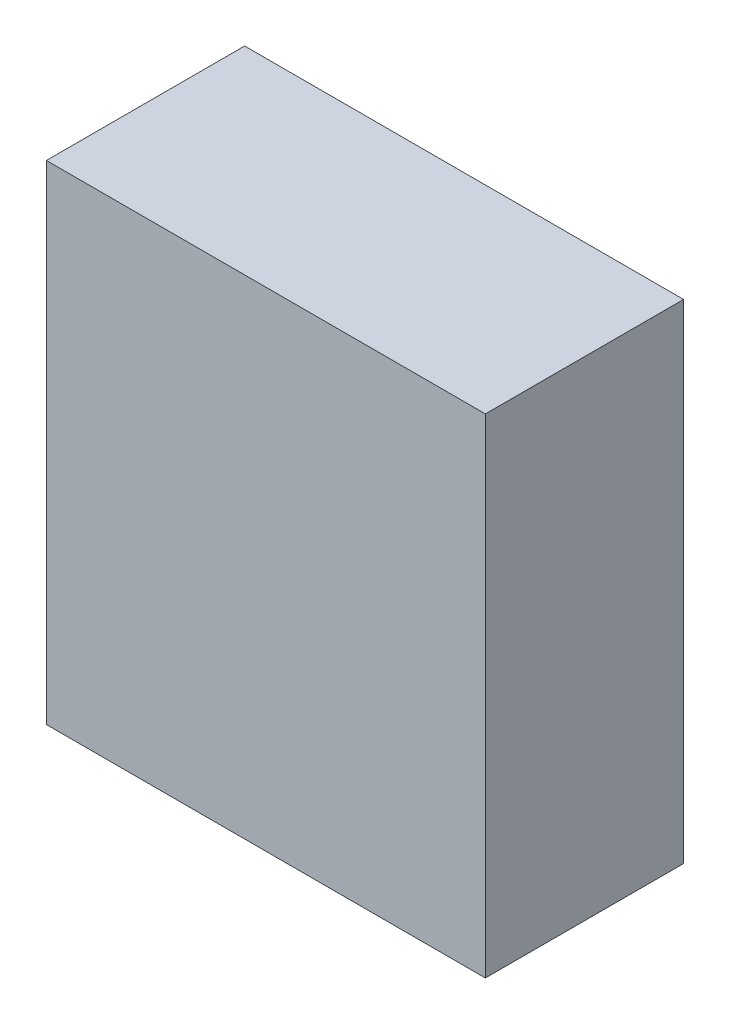
ISO-10303-21;
HEADER;
FILE_DESCRIPTION(('STEP AP214'),'2;1');
FILE_NAME('part.step','',(''),(''),'','','');
FILE_SCHEMA(('AUTOMOTIVE_DESIGN { 1 0 10303 214 1 1 1 1 }'));
ENDSEC;
DATA;
#1=APPLICATION_CONTEXT('core data for automotive mechanical design processes');
#2=APPLICATION_PROTOCOL_DEFINITION('international standard','automotive_design',2000,#1);
#3=PRODUCT_CONTEXT('',#1,'mechanical');
#4=PRODUCT('Part','Part','',(#3));
#5=PRODUCT_RELATED_PRODUCT_CATEGORY('part','',(#4));
#6=PRODUCT_DEFINITION_FORMATION('','',#4);
#7=PRODUCT_DEFINITION_CONTEXT('part definition',#1,'design');
#8=PRODUCT_DEFINITION('design','',#6,#7);
#9=PRODUCT_DEFINITION_SHAPE('','',#8);
#10=(LENGTH_UNIT() NAMED_UNIT(*) SI_UNIT(.MILLI.,.METRE.));
#11=(NAMED_UNIT(*) PLANE_ANGLE_UNIT() SI_UNIT($,.RADIAN.));
#12=(NAMED_UNIT(*) SI_UNIT($,.STERADIAN.) SOLID_ANGLE_UNIT());
#13=UNCERTAINTY_MEASURE_WITH_UNIT(LENGTH_MEASURE(1.E-05),#10,'distance_accuracy_value','');
#14=(GEOMETRIC_REPRESENTATION_CONTEXT(3) GLOBAL_UNCERTAINTY_ASSIGNED_CONTEXT((#13)) GLOBAL_UNIT_ASSIGNED_CONTEXT((#10,
#11,#12)) REPRESENTATION_CONTEXT('',''));
#15=CARTESIAN_POINT('',(0.,0.,0.));
#16=DIRECTION('',(0.,0.,1.));
#17=DIRECTION('',(1.,0.,0.));
#18=AXIS2_PLACEMENT_3D('',#15,#16,#17);
#19=CARTESIAN_POINT('',(-1.54999944,-1.72500036,1.39999974));
#20=DIRECTION('',(0.,0.,-1.));
#21=DIRECTION('',(-1.,0.,0.));
#22=AXIS2_PLACEMENT_3D('',#19,#20,#21);
#23=PLANE('',#22);
#24=DIRECTION('',(0.,1.,0.));
#25=VECTOR('',#24,1.);
#26=CARTESIAN_POINT('',(1.54999944,-1.72500036,1.39999974));
#27=LINE('',#26,#25);
#28=CARTESIAN_POINT('',(1.54999944,-1.72500036,1.39999974));
#29=VERTEX_POINT('',#28);
#30=CARTESIAN_POINT('',(1.54999944,1.72500036,1.39999974));
#31=VERTEX_POINT('',#30);
#32=EDGE_CURVE('E55',#29,#31,#27,.T.);
#33=ORIENTED_EDGE('',*,*,#32,.T.);
#34=DIRECTION('',(1.,0.,0.));
#35=VECTOR('',#34,1.);
#36=CARTESIAN_POINT('',(1.54999944,1.72500036,1.39999974));
#37=LINE('',#36,#35);
#38=CARTESIAN_POINT('',(-1.54999944,1.72500036,1.39999974));
#39=VERTEX_POINT('',#38);
#40=EDGE_CURVE('E57',#31,#39,#37,.F.);
#41=ORIENTED_EDGE('',*,*,#40,.T.);
#42=DIRECTION('',(0.,1.,0.));
#43=VECTOR('',#42,1.);
#44=CARTESIAN_POINT('',(-1.54999944,1.72500036,1.39999974));
#45=LINE('',#44,#43);
#46=CARTESIAN_POINT('',(-1.54999944,-1.72500036,1.39999974));
#47=VERTEX_POINT('',#46);
#48=EDGE_CURVE('E20',#39,#47,#45,.F.);
#49=ORIENTED_EDGE('',*,*,#48,.T.);
#50=DIRECTION('',(1.,0.,0.));
#51=VECTOR('',#50,1.);
#52=CARTESIAN_POINT('',(-1.54999944,-1.72500036,1.39999974));
#53=LINE('',#52,#51);
#54=EDGE_CURVE('E80',#47,#29,#53,.T.);
#55=ORIENTED_EDGE('',*,*,#54,.T.);
#56=EDGE_LOOP('',(#33,#41,#49,#55));
#57=FACE_BOUND('',#56,.T.);
#58=ADVANCED_FACE('F17',(#57),#23,.F.);
#59=CARTESIAN_POINT('',(-1.54999944,1.72500036,0.));
#60=DIRECTION('',(1.,0.,0.));
#61=DIRECTION('',(0.,0.,-1.));
#62=AXIS2_PLACEMENT_3D('',#59,#60,#61);
#63=PLANE('',#62);
#64=DIRECTION('',(0.,0.,1.));
#65=VECTOR('',#64,1.);
#66=CARTESIAN_POINT('',(-1.54999944,-1.72500036,0.));
#67=LINE('',#66,#65);
#68=CARTESIAN_POINT('',(-1.54999944,-1.72500036,0.));
#69=VERTEX_POINT('',#68);
#70=EDGE_CURVE('E68',#69,#47,#67,.T.);
#71=ORIENTED_EDGE('',*,*,#70,.T.);
#72=ORIENTED_EDGE('',*,*,#48,.F.);
#73=DIRECTION('',(0.,0.,-1.));
#74=VECTOR('',#73,1.);
#75=CARTESIAN_POINT('',(-1.54999944,1.72500036,0.));
#76=LINE('',#75,#74);
#77=CARTESIAN_POINT('',(-1.54999944,1.72500036,0.));
#78=VERTEX_POINT('',#77);
#79=EDGE_CURVE('E63',#39,#78,#76,.T.);
#80=ORIENTED_EDGE('',*,*,#79,.T.);
#81=DIRECTION('',(0.,1.,0.));
#82=VECTOR('',#81,1.);
#83=CARTESIAN_POINT('',(-1.54999944,-1.72500036,0.));
#84=LINE('',#83,#82);
#85=EDGE_CURVE('E83',#69,#78,#84,.T.);
#86=ORIENTED_EDGE('',*,*,#85,.F.);
#87=EDGE_LOOP('',(#71,#72,#80,#86));
#88=FACE_BOUND('',#87,.T.);
#89=ADVANCED_FACE('F65',(#88),#63,.F.);
#90=CARTESIAN_POINT('',(1.54999944,1.72500036,0.));
#91=DIRECTION('',(0.,-1.,0.));
#92=DIRECTION('',(0.,0.,-1.));
#93=AXIS2_PLACEMENT_3D('',#90,#91,#92);
#94=PLANE('',#93);
#95=ORIENTED_EDGE('',*,*,#79,.F.);
#96=ORIENTED_EDGE('',*,*,#40,.F.);
#97=DIRECTION('',(0.,0.,1.));
#98=VECTOR('',#97,1.);
#99=CARTESIAN_POINT('',(1.54999944,1.72500036,0.));
#100=LINE('',#99,#98);
#101=CARTESIAN_POINT('',(1.54999944,1.72500036,0.));
#102=VERTEX_POINT('',#101);
#103=EDGE_CURVE('E75',#31,#102,#100,.F.);
#104=ORIENTED_EDGE('',*,*,#103,.T.);
#105=DIRECTION('',(-1.,0.,0.));
#106=VECTOR('',#105,1.);
#107=CARTESIAN_POINT('',(-1.54999944,1.72500036,0.));
#108=LINE('',#107,#106);
#109=EDGE_CURVE('E72',#78,#102,#108,.F.);
#110=ORIENTED_EDGE('',*,*,#109,.F.);
#111=EDGE_LOOP('',(#95,#96,#104,#110));
#112=FACE_BOUND('',#111,.T.);
#113=ADVANCED_FACE('F70',(#112),#94,.F.);
#114=CARTESIAN_POINT('',(1.54999944,-1.72500036,0.));
#115=DIRECTION('',(-1.,0.,0.));
#116=DIRECTION('',(0.,0.,1.));
#117=AXIS2_PLACEMENT_3D('',#114,#115,#116);
#118=PLANE('',#117);
#119=ORIENTED_EDGE('',*,*,#103,.F.);
#120=ORIENTED_EDGE('',*,*,#32,.F.);
#121=DIRECTION('',(0.,0.,1.));
#122=VECTOR('',#121,1.);
#123=CARTESIAN_POINT('',(1.54999944,-1.72500036,0.));
#124=LINE('',#123,#122);
#125=CARTESIAN_POINT('',(1.54999944,-1.72500036,0.));
#126=VERTEX_POINT('',#125);
#127=EDGE_CURVE('E35',#29,#126,#124,.F.);
#128=ORIENTED_EDGE('',*,*,#127,.T.);
#129=DIRECTION('',(0.,1.,0.));
#130=VECTOR('',#129,1.);
#131=CARTESIAN_POINT('',(1.54999944,-1.72500036,0.));
#132=LINE('',#131,#130);
#133=EDGE_CURVE('E26',#102,#126,#132,.F.);
#134=ORIENTED_EDGE('',*,*,#133,.F.);
#135=EDGE_LOOP('',(#119,#120,#128,#134));
#136=FACE_BOUND('',#135,.T.);
#137=ADVANCED_FACE('F89',(#136),#118,.F.);
#138=CARTESIAN_POINT('',(-1.54999944,-1.72500036,0.));
#139=DIRECTION('',(0.,1.,0.));
#140=DIRECTION('',(0.,0.,1.));
#141=AXIS2_PLACEMENT_3D('',#138,#139,#140);
#142=PLANE('',#141);
#143=ORIENTED_EDGE('',*,*,#127,.F.);
#144=ORIENTED_EDGE('',*,*,#54,.F.);
#145=ORIENTED_EDGE('',*,*,#70,.F.);
#146=DIRECTION('',(-1.,0.,0.));
#147=VECTOR('',#146,1.);
#148=CARTESIAN_POINT('',(-1.54999944,-1.72500036,0.));
#149=LINE('',#148,#147);
#150=EDGE_CURVE('E11',#126,#69,#149,.T.);
#151=ORIENTED_EDGE('',*,*,#150,.F.);
#152=EDGE_LOOP('',(#143,#144,#145,#151));
#153=FACE_BOUND('',#152,.T.);
#154=ADVANCED_FACE('F91',(#153),#142,.F.);
#155=CARTESIAN_POINT('',(-1.54999944,-1.72500036,0.));
#156=DIRECTION('',(0.,0.,-1.));
#157=DIRECTION('',(-1.,0.,0.));
#158=AXIS2_PLACEMENT_3D('',#155,#156,#157);
#159=PLANE('',#158);
#160=ORIENTED_EDGE('',*,*,#133,.T.);
#161=ORIENTED_EDGE('',*,*,#150,.T.);
#162=ORIENTED_EDGE('',*,*,#85,.T.);
#163=ORIENTED_EDGE('',*,*,#109,.T.);
#164=EDGE_LOOP('',(#160,#161,#162,#163));
#165=FACE_BOUND('',#164,.T.);
#166=ADVANCED_FACE('F88',(#165),#159,.T.);
#167=CLOSED_SHELL('',(#58,#89,#113,#137,#154,#166));
#168=MANIFOLD_SOLID_BREP('B1',#167);
#169=ADVANCED_BREP_SHAPE_REPRESENTATION('',(#18,#168),#14);
#170=SHAPE_DEFINITION_REPRESENTATION(#9,#169);
ENDSEC;
END-ISO-10303-21;
